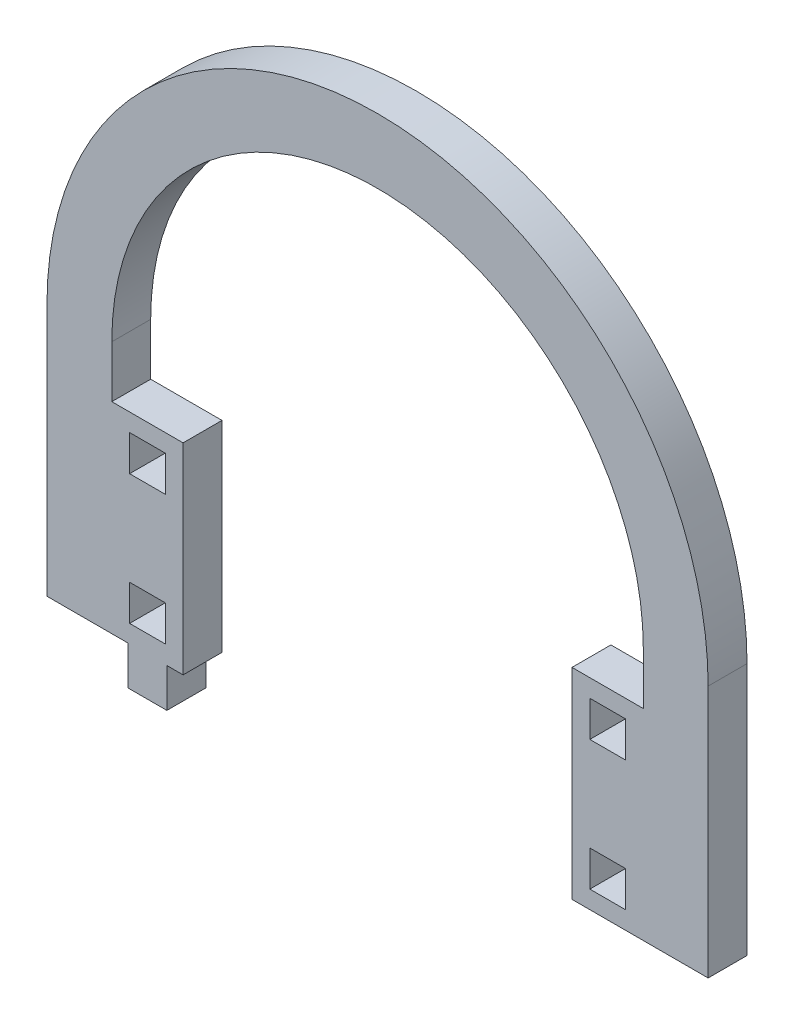
ISO-10303-21;
HEADER;
FILE_DESCRIPTION(('STEP AP214'),'2;1');
FILE_NAME('part.step','',(''),(''),'','','');
FILE_SCHEMA(('AUTOMOTIVE_DESIGN { 1 0 10303 214 1 1 1 1 }'));
ENDSEC;
DATA;
#1=APPLICATION_CONTEXT('core data for automotive mechanical design processes');
#2=APPLICATION_PROTOCOL_DEFINITION('international standard','automotive_design',2000,#1);
#3=PRODUCT_CONTEXT('',#1,'mechanical');
#4=PRODUCT('Part','Part','',(#3));
#5=PRODUCT_RELATED_PRODUCT_CATEGORY('part','',(#4));
#6=PRODUCT_DEFINITION_FORMATION('','',#4);
#7=PRODUCT_DEFINITION_CONTEXT('part definition',#1,'design');
#8=PRODUCT_DEFINITION('design','',#6,#7);
#9=PRODUCT_DEFINITION_SHAPE('','',#8);
#10=(LENGTH_UNIT() NAMED_UNIT(*) SI_UNIT(.MILLI.,.METRE.));
#11=(NAMED_UNIT(*) PLANE_ANGLE_UNIT() SI_UNIT($,.RADIAN.));
#12=(NAMED_UNIT(*) SI_UNIT($,.STERADIAN.) SOLID_ANGLE_UNIT());
#13=UNCERTAINTY_MEASURE_WITH_UNIT(LENGTH_MEASURE(1.E-05),#10,'distance_accuracy_value','');
#14=(GEOMETRIC_REPRESENTATION_CONTEXT(3) GLOBAL_UNCERTAINTY_ASSIGNED_CONTEXT((#13)) GLOBAL_UNIT_ASSIGNED_CONTEXT((#10,
#11,#12)) REPRESENTATION_CONTEXT('',''));
#15=CARTESIAN_POINT('',(0.,0.,0.));
#16=DIRECTION('',(0.,0.,1.));
#17=DIRECTION('',(1.,0.,0.));
#18=AXIS2_PLACEMENT_3D('',#15,#16,#17);
#19=CARTESIAN_POINT('',(3033.61236918884,1260.80884612332,6.));
#20=DIRECTION('',(0.,0.,1.));
#21=DIRECTION('',(1.,0.,0.));
#22=AXIS2_PLACEMENT_3D('',#19,#20,#21);
#23=PLANE('',#22);
#24=CARTESIAN_POINT('',(3033.61236918884,1260.80884612332,6.));
#25=DIRECTION('',(0.,0.,1.));
#26=DIRECTION('',(1.,0.,0.));
#27=AXIS2_PLACEMENT_3D('',#24,#25,#26);
#28=CIRCLE('',#27,51.0000000000002);
#29=CARTESIAN_POINT('',(3084.61236918884,1260.80884612332,6.));
#30=VERTEX_POINT('',#29);
#31=CARTESIAN_POINT('',(2982.61236918884,1260.80884612332,6.));
#32=VERTEX_POINT('',#31);
#33=EDGE_CURVE('E678',#30,#32,#28,.T.);
#34=ORIENTED_EDGE('',*,*,#33,.T.);
#35=DIRECTION('',(0.,-1.,0.));
#36=VECTOR('',#35,1.);
#37=CARTESIAN_POINT('',(2982.61236918884,1260.80884612332,6.));
#38=LINE('',#37,#36);
#39=CARTESIAN_POINT('',(2982.61236918884,1221.80884612332,6.));
#40=VERTEX_POINT('',#39);
#41=EDGE_CURVE('E682',#32,#40,#38,.T.);
#42=ORIENTED_EDGE('',*,*,#41,.T.);
#43=DIRECTION('',(1.,0.,0.));
#44=VECTOR('',#43,1.);
#45=CARTESIAN_POINT('',(2982.61236918884,1221.80884612332,6.));
#46=LINE('',#45,#44);
#47=CARTESIAN_POINT('',(2995.11236918884,1221.80884612332,6.));
#48=VERTEX_POINT('',#47);
#49=EDGE_CURVE('E686',#40,#48,#46,.T.);
#50=ORIENTED_EDGE('',*,*,#49,.T.);
#51=DIRECTION('',(0.,-1.,0.));
#52=VECTOR('',#51,1.);
#53=CARTESIAN_POINT('',(2995.11236918884,1221.80884612332,6.));
#54=LINE('',#53,#52);
#55=CARTESIAN_POINT('',(2995.11236918884,1215.80884612332,6.));
#56=VERTEX_POINT('',#55);
#57=EDGE_CURVE('E689',#48,#56,#54,.T.);
#58=ORIENTED_EDGE('',*,*,#57,.T.);
#59=DIRECTION('',(1.,0.,0.));
#60=VECTOR('',#59,1.);
#61=CARTESIAN_POINT('',(2995.11236918884,1215.80884612332,6.));
#62=LINE('',#61,#60);
#63=CARTESIAN_POINT('',(3001.11236918884,1215.80884612332,6.));
#64=VERTEX_POINT('',#63);
#65=EDGE_CURVE('E692',#56,#64,#62,.T.);
#66=ORIENTED_EDGE('',*,*,#65,.T.);
#67=DIRECTION('',(0.,1.,0.));
#68=VECTOR('',#67,1.);
#69=CARTESIAN_POINT('',(3001.11236918884,1215.80884612332,6.));
#70=LINE('',#69,#68);
#71=CARTESIAN_POINT('',(3001.11236918884,1221.80884612332,6.));
#72=VERTEX_POINT('',#71);
#73=EDGE_CURVE('E695',#64,#72,#70,.T.);
#74=ORIENTED_EDGE('',*,*,#73,.T.);
#75=DIRECTION('',(1.,0.,0.));
#76=VECTOR('',#75,1.);
#77=CARTESIAN_POINT('',(3001.11236918884,1221.80884612332,6.));
#78=LINE('',#77,#76);
#79=CARTESIAN_POINT('',(3003.61236918884,1221.80884612332,6.));
#80=VERTEX_POINT('',#79);
#81=EDGE_CURVE('E698',#72,#80,#78,.T.);
#82=ORIENTED_EDGE('',*,*,#81,.T.);
#83=DIRECTION('',(0.,-1.,0.));
#84=VECTOR('',#83,1.);
#85=CARTESIAN_POINT('',(3003.61236918884,1252.80884612332,6.));
#86=LINE('',#85,#84);
#87=CARTESIAN_POINT('',(3003.61236918884,1252.80884612332,6.));
#88=VERTEX_POINT('',#87);
#89=EDGE_CURVE('E701',#88,#80,#86,.T.);
#90=ORIENTED_EDGE('',*,*,#89,.F.);
#91=DIRECTION('',(-1.,0.,0.));
#92=VECTOR('',#91,1.);
#93=CARTESIAN_POINT('',(3003.61236918884,1252.80884612332,6.));
#94=LINE('',#93,#92);
#95=CARTESIAN_POINT('',(2992.61236918884,1252.80884612332,6.));
#96=VERTEX_POINT('',#95);
#97=EDGE_CURVE('E705',#88,#96,#94,.T.);
#98=ORIENTED_EDGE('',*,*,#97,.T.);
#99=DIRECTION('',(0.,-1.,0.));
#100=VECTOR('',#99,1.);
#101=CARTESIAN_POINT('',(2992.61236918884,1260.80884612332,6.));
#102=LINE('',#101,#100);
#103=CARTESIAN_POINT('',(2992.61236918884,1260.80884612332,6.));
#104=VERTEX_POINT('',#103);
#105=EDGE_CURVE('E708',#104,#96,#102,.T.);
#106=ORIENTED_EDGE('',*,*,#105,.F.);
#107=CARTESIAN_POINT('',(3033.61236918884,1260.80884612332,6.));
#108=DIRECTION('',(0.,0.,1.));
#109=DIRECTION('',(1.,0.,0.));
#110=AXIS2_PLACEMENT_3D('',#107,#108,#109);
#111=CIRCLE('',#110,40.9999999999999);
#112=CARTESIAN_POINT('',(3074.61236918884,1260.80884612332,6.));
#113=VERTEX_POINT('',#112);
#114=EDGE_CURVE('E712',#113,#104,#111,.T.);
#115=ORIENTED_EDGE('',*,*,#114,.F.);
#116=DIRECTION('',(0.,-1.,0.));
#117=VECTOR('',#116,1.);
#118=CARTESIAN_POINT('',(3074.61236918884,1260.80884612332,6.));
#119=LINE('',#118,#117);
#120=CARTESIAN_POINT('',(3074.61236918884,1252.80884612332,6.));
#121=VERTEX_POINT('',#120);
#122=EDGE_CURVE('E716',#113,#121,#119,.T.);
#123=ORIENTED_EDGE('',*,*,#122,.T.);
#124=DIRECTION('',(-1.,0.,0.));
#125=VECTOR('',#124,1.);
#126=CARTESIAN_POINT('',(3074.61236918884,1252.80884612332,6.));
#127=LINE('',#126,#125);
#128=CARTESIAN_POINT('',(3063.61236918884,1252.80884612332,6.));
#129=VERTEX_POINT('',#128);
#130=EDGE_CURVE('E719',#121,#129,#127,.T.);
#131=ORIENTED_EDGE('',*,*,#130,.T.);
#132=DIRECTION('',(0.,-1.,0.));
#133=VECTOR('',#132,1.);
#134=CARTESIAN_POINT('',(3063.61236918884,1252.80884612332,6.));
#135=LINE('',#134,#133);
#136=CARTESIAN_POINT('',(3063.61236918884,1221.80884612332,6.));
#137=VERTEX_POINT('',#136);
#138=EDGE_CURVE('E722',#129,#137,#135,.T.);
#139=ORIENTED_EDGE('',*,*,#138,.T.);
#140=DIRECTION('',(1.,0.,0.));
#141=VECTOR('',#140,1.);
#142=CARTESIAN_POINT('',(3063.61236918884,1221.80884612332,6.));
#143=LINE('',#142,#141);
#144=CARTESIAN_POINT('',(3084.61236918884,1221.80884612332,6.));
#145=VERTEX_POINT('',#144);
#146=EDGE_CURVE('E725',#137,#145,#143,.T.);
#147=ORIENTED_EDGE('',*,*,#146,.T.);
#148=DIRECTION('',(0.,-1.,0.));
#149=VECTOR('',#148,1.);
#150=CARTESIAN_POINT('',(3084.61236918884,1260.80884612332,6.));
#151=LINE('',#150,#149);
#152=EDGE_CURVE('E728',#30,#145,#151,.T.);
#153=ORIENTED_EDGE('',*,*,#152,.F.);
#154=EDGE_LOOP('',(#34,#42,#50,#58,#66,#74,#82,#90,#98,#106,#115,#123,#131,#139,#147,#153));
#155=FACE_BOUND('',#154,.T.);
#156=DIRECTION('',(0.,1.,0.));
#157=VECTOR('',#156,1.);
#158=CARTESIAN_POINT('',(3000.86236918884,0.,6.));
#159=LINE('',#158,#157);
#160=CARTESIAN_POINT('',(3000.86236918884,1224.55884612332,6.));
#161=VERTEX_POINT('',#160);
#162=CARTESIAN_POINT('',(3000.86236918884,1230.05884612332,6.));
#163=VERTEX_POINT('',#162);
#164=EDGE_CURVE('E638',#161,#163,#159,.T.);
#165=ORIENTED_EDGE('',*,*,#164,.F.);
#166=DIRECTION('',(1.,0.,0.));
#167=VECTOR('',#166,1.);
#168=CARTESIAN_POINT('',(0.,1224.55884612332,6.));
#169=LINE('',#168,#167);
#170=CARTESIAN_POINT('',(2995.36236918884,1224.55884612332,6.));
#171=VERTEX_POINT('',#170);
#172=EDGE_CURVE('E635',#171,#161,#169,.T.);
#173=ORIENTED_EDGE('',*,*,#172,.F.);
#174=DIRECTION('',(0.,-1.,0.));
#175=VECTOR('',#174,1.);
#176=CARTESIAN_POINT('',(2995.36236918884,0.,6.));
#177=LINE('',#176,#175);
#178=CARTESIAN_POINT('',(2995.36236918884,1230.05884612332,6.));
#179=VERTEX_POINT('',#178);
#180=EDGE_CURVE('E646',#179,#171,#177,.T.);
#181=ORIENTED_EDGE('',*,*,#180,.F.);
#182=DIRECTION('',(-1.,0.,0.));
#183=VECTOR('',#182,1.);
#184=CARTESIAN_POINT('',(0.,1230.05884612332,6.));
#185=LINE('',#184,#183);
#186=EDGE_CURVE('E642',#163,#179,#185,.T.);
#187=ORIENTED_EDGE('',*,*,#186,.F.);
#188=EDGE_LOOP('',(#165,#173,#181,#187));
#189=FACE_BOUND('',#188,.T.);
#190=DIRECTION('',(0.,1.,0.));
#191=VECTOR('',#190,1.);
#192=CARTESIAN_POINT('',(3071.86236918884,0.,6.));
#193=LINE('',#192,#191);
#194=CARTESIAN_POINT('',(3071.86236918884,1244.55884612332,6.));
#195=VERTEX_POINT('',#194);
#196=CARTESIAN_POINT('',(3071.86236918884,1250.05884612332,6.));
#197=VERTEX_POINT('',#196);
#198=EDGE_CURVE('E595',#195,#197,#193,.T.);
#199=ORIENTED_EDGE('',*,*,#198,.F.);
#200=DIRECTION('',(1.,0.,0.));
#201=VECTOR('',#200,1.);
#202=CARTESIAN_POINT('',(0.,1244.55884612332,6.));
#203=LINE('',#202,#201);
#204=CARTESIAN_POINT('',(3066.36236918884,1244.55884612332,6.));
#205=VERTEX_POINT('',#204);
#206=EDGE_CURVE('E592',#205,#195,#203,.T.);
#207=ORIENTED_EDGE('',*,*,#206,.F.);
#208=DIRECTION('',(0.,-1.,0.));
#209=VECTOR('',#208,1.);
#210=CARTESIAN_POINT('',(3066.36236918884,0.,6.));
#211=LINE('',#210,#209);
#212=CARTESIAN_POINT('',(3066.36236918884,1250.05884612332,6.));
#213=VERTEX_POINT('',#212);
#214=EDGE_CURVE('E603',#213,#205,#211,.T.);
#215=ORIENTED_EDGE('',*,*,#214,.F.);
#216=DIRECTION('',(-1.,0.,0.));
#217=VECTOR('',#216,1.);
#218=CARTESIAN_POINT('',(0.,1250.05884612332,6.));
#219=LINE('',#218,#217);
#220=EDGE_CURVE('E599',#197,#213,#219,.T.);
#221=ORIENTED_EDGE('',*,*,#220,.F.);
#222=EDGE_LOOP('',(#199,#207,#215,#221));
#223=FACE_BOUND('',#222,.T.);
#224=DIRECTION('',(0.,1.,0.));
#225=VECTOR('',#224,1.);
#226=CARTESIAN_POINT('',(3071.86236918884,0.,6.));
#227=LINE('',#226,#225);
#228=CARTESIAN_POINT('',(3071.86236918884,1224.55884612332,6.));
#229=VERTEX_POINT('',#228);
#230=CARTESIAN_POINT('',(3071.86236918884,1230.05884612332,6.));
#231=VERTEX_POINT('',#230);
#232=EDGE_CURVE('E552',#229,#231,#227,.T.);
#233=ORIENTED_EDGE('',*,*,#232,.F.);
#234=DIRECTION('',(1.,0.,0.));
#235=VECTOR('',#234,1.);
#236=CARTESIAN_POINT('',(0.,1224.55884612332,6.));
#237=LINE('',#236,#235);
#238=CARTESIAN_POINT('',(3066.36236918884,1224.55884612332,6.));
#239=VERTEX_POINT('',#238);
#240=EDGE_CURVE('E549',#239,#229,#237,.T.);
#241=ORIENTED_EDGE('',*,*,#240,.F.);
#242=DIRECTION('',(0.,-1.,0.));
#243=VECTOR('',#242,1.);
#244=CARTESIAN_POINT('',(3066.36236918884,0.,6.));
#245=LINE('',#244,#243);
#246=CARTESIAN_POINT('',(3066.36236918884,1230.05884612332,6.));
#247=VERTEX_POINT('',#246);
#248=EDGE_CURVE('E560',#247,#239,#245,.T.);
#249=ORIENTED_EDGE('',*,*,#248,.F.);
#250=DIRECTION('',(-1.,0.,0.));
#251=VECTOR('',#250,1.);
#252=CARTESIAN_POINT('',(0.,1230.05884612332,6.));
#253=LINE('',#252,#251);
#254=EDGE_CURVE('E556',#231,#247,#253,.T.);
#255=ORIENTED_EDGE('',*,*,#254,.F.);
#256=EDGE_LOOP('',(#233,#241,#249,#255));
#257=FACE_BOUND('',#256,.T.);
#258=DIRECTION('',(1.,0.,0.));
#259=VECTOR('',#258,1.);
#260=CARTESIAN_POINT('',(2995.36236918884,1244.55884612332,6.));
#261=LINE('',#260,#259);
#262=CARTESIAN_POINT('',(2995.36236918884,1244.55884612332,6.));
#263=VERTEX_POINT('',#262);
#264=CARTESIAN_POINT('',(3000.86236918884,1244.55884612332,6.));
#265=VERTEX_POINT('',#264);
#266=EDGE_CURVE('E510',#263,#265,#261,.T.);
#267=ORIENTED_EDGE('',*,*,#266,.F.);
#268=DIRECTION('',(0.,-1.,0.));
#269=VECTOR('',#268,1.);
#270=CARTESIAN_POINT('',(2995.36236918884,1250.05884612332,6.));
#271=LINE('',#270,#269);
#272=CARTESIAN_POINT('',(2995.36236918884,1250.05884612332,6.));
#273=VERTEX_POINT('',#272);
#274=EDGE_CURVE('E501',#273,#263,#271,.T.);
#275=ORIENTED_EDGE('',*,*,#274,.F.);
#276=DIRECTION('',(-1.,0.,0.));
#277=VECTOR('',#276,1.);
#278=CARTESIAN_POINT('',(3000.86236918884,1250.05884612332,6.));
#279=LINE('',#278,#277);
#280=CARTESIAN_POINT('',(3000.86236918884,1250.05884612332,6.));
#281=VERTEX_POINT('',#280);
#282=EDGE_CURVE('E527',#281,#273,#279,.T.);
#283=ORIENTED_EDGE('',*,*,#282,.F.);
#284=DIRECTION('',(0.,1.,0.));
#285=VECTOR('',#284,1.);
#286=CARTESIAN_POINT('',(3000.86236918884,1244.55884612332,6.));
#287=LINE('',#286,#285);
#288=EDGE_CURVE('E523',#265,#281,#287,.T.);
#289=ORIENTED_EDGE('',*,*,#288,.F.);
#290=EDGE_LOOP('',(#267,#275,#283,#289));
#291=FACE_BOUND('',#290,.T.);
#292=ADVANCED_FACE('F291',(#155,#189,#223,#257,#291),#23,.T.);
#293=CARTESIAN_POINT('',(3033.61236918884,1260.80884612332,0.));
#294=DIRECTION('',(0.,0.,1.));
#295=DIRECTION('',(1.,0.,0.));
#296=AXIS2_PLACEMENT_3D('',#293,#294,#295);
#297=PLANE('',#296);
#298=DIRECTION('',(1.,0.,0.));
#299=VECTOR('',#298,1.);
#300=CARTESIAN_POINT('',(0.,1224.55884612332,0.));
#301=LINE('',#300,#299);
#302=CARTESIAN_POINT('',(3066.36236918884,1224.55884612332,0.));
#303=VERTEX_POINT('',#302);
#304=CARTESIAN_POINT('',(3071.86236918884,1224.55884612332,0.));
#305=VERTEX_POINT('',#304);
#306=EDGE_CURVE('E519',#303,#305,#301,.T.);
#307=ORIENTED_EDGE('',*,*,#306,.T.);
#308=DIRECTION('',(0.,1.,0.));
#309=VECTOR('',#308,1.);
#310=CARTESIAN_POINT('',(3071.86236918884,0.,0.));
#311=LINE('',#310,#309);
#312=CARTESIAN_POINT('',(3071.86236918884,1230.05884612332,0.));
#313=VERTEX_POINT('',#312);
#314=EDGE_CURVE('E567',#305,#313,#311,.T.);
#315=ORIENTED_EDGE('',*,*,#314,.T.);
#316=DIRECTION('',(-1.,0.,0.));
#317=VECTOR('',#316,1.);
#318=CARTESIAN_POINT('',(0.,1230.05884612332,0.));
#319=LINE('',#318,#317);
#320=CARTESIAN_POINT('',(3066.36236918884,1230.05884612332,0.));
#321=VERTEX_POINT('',#320);
#322=EDGE_CURVE('E571',#313,#321,#319,.T.);
#323=ORIENTED_EDGE('',*,*,#322,.T.);
#324=DIRECTION('',(0.,-1.,0.));
#325=VECTOR('',#324,1.);
#326=CARTESIAN_POINT('',(3066.36236918884,0.,0.));
#327=LINE('',#326,#325);
#328=EDGE_CURVE('E553',#321,#303,#327,.T.);
#329=ORIENTED_EDGE('',*,*,#328,.T.);
#330=EDGE_LOOP('',(#307,#315,#323,#329));
#331=FACE_BOUND('',#330,.T.);
#332=DIRECTION('',(1.,0.,0.));
#333=VECTOR('',#332,1.);
#334=CARTESIAN_POINT('',(0.,1224.55884612332,0.));
#335=LINE('',#334,#333);
#336=CARTESIAN_POINT('',(2995.36236918884,1224.55884612332,0.));
#337=VERTEX_POINT('',#336);
#338=CARTESIAN_POINT('',(3000.86236918884,1224.55884612332,0.));
#339=VERTEX_POINT('',#338);
#340=EDGE_CURVE('E634',#337,#339,#335,.T.);
#341=ORIENTED_EDGE('',*,*,#340,.T.);
#342=DIRECTION('',(0.,1.,0.));
#343=VECTOR('',#342,1.);
#344=CARTESIAN_POINT('',(3000.86236918884,0.,0.));
#345=LINE('',#344,#343);
#346=CARTESIAN_POINT('',(3000.86236918884,1230.05884612332,0.));
#347=VERTEX_POINT('',#346);
#348=EDGE_CURVE('E653',#339,#347,#345,.T.);
#349=ORIENTED_EDGE('',*,*,#348,.T.);
#350=DIRECTION('',(-1.,0.,0.));
#351=VECTOR('',#350,1.);
#352=CARTESIAN_POINT('',(0.,1230.05884612332,0.));
#353=LINE('',#352,#351);
#354=CARTESIAN_POINT('',(2995.36236918884,1230.05884612332,0.));
#355=VERTEX_POINT('',#354);
#356=EDGE_CURVE('E657',#347,#355,#353,.T.);
#357=ORIENTED_EDGE('',*,*,#356,.T.);
#358=DIRECTION('',(0.,-1.,0.));
#359=VECTOR('',#358,1.);
#360=CARTESIAN_POINT('',(2995.36236918884,0.,0.));
#361=LINE('',#360,#359);
#362=EDGE_CURVE('E639',#355,#337,#361,.T.);
#363=ORIENTED_EDGE('',*,*,#362,.T.);
#364=EDGE_LOOP('',(#341,#349,#357,#363));
#365=FACE_BOUND('',#364,.T.);
#366=CARTESIAN_POINT('',(3033.61236918884,1260.80884612332,0.));
#367=DIRECTION('',(0.,0.,1.));
#368=DIRECTION('',(1.,0.,0.));
#369=AXIS2_PLACEMENT_3D('',#366,#367,#368);
#370=CIRCLE('',#369,51.0000000000002);
#371=CARTESIAN_POINT('',(3084.61236918884,1260.80884612332,0.));
#372=VERTEX_POINT('',#371);
#373=CARTESIAN_POINT('',(2982.61236918884,1260.80884612332,0.));
#374=VERTEX_POINT('',#373);
#375=EDGE_CURVE('E677',#372,#374,#370,.T.);
#376=ORIENTED_EDGE('',*,*,#375,.F.);
#377=DIRECTION('',(0.,-1.,0.));
#378=VECTOR('',#377,1.);
#379=CARTESIAN_POINT('',(3084.61236918884,1260.80884612332,0.));
#380=LINE('',#379,#378);
#381=CARTESIAN_POINT('',(3084.61236918884,1221.80884612332,0.));
#382=VERTEX_POINT('',#381);
#383=EDGE_CURVE('E683',#372,#382,#380,.T.);
#384=ORIENTED_EDGE('',*,*,#383,.T.);
#385=DIRECTION('',(1.,0.,0.));
#386=VECTOR('',#385,1.);
#387=CARTESIAN_POINT('',(3074.61236918884,1221.80884612332,0.));
#388=LINE('',#387,#386);
#389=CARTESIAN_POINT('',(3063.61236918884,1221.80884612332,0.));
#390=VERTEX_POINT('',#389);
#391=EDGE_CURVE('E781',#390,#382,#388,.T.);
#392=ORIENTED_EDGE('',*,*,#391,.F.);
#393=DIRECTION('',(0.,-1.,0.));
#394=VECTOR('',#393,1.);
#395=CARTESIAN_POINT('',(3063.61236918884,1252.80884612332,0.));
#396=LINE('',#395,#394);
#397=CARTESIAN_POINT('',(3063.61236918884,1252.80884612332,0.));
#398=VERTEX_POINT('',#397);
#399=EDGE_CURVE('E777',#398,#390,#396,.T.);
#400=ORIENTED_EDGE('',*,*,#399,.F.);
#401=DIRECTION('',(-1.,0.,0.));
#402=VECTOR('',#401,1.);
#403=CARTESIAN_POINT('',(3074.61236918884,1252.80884612332,0.));
#404=LINE('',#403,#402);
#405=CARTESIAN_POINT('',(3074.61236918884,1252.80884612332,0.));
#406=VERTEX_POINT('',#405);
#407=EDGE_CURVE('E774',#406,#398,#404,.T.);
#408=ORIENTED_EDGE('',*,*,#407,.F.);
#409=DIRECTION('',(0.,-1.,0.));
#410=VECTOR('',#409,1.);
#411=CARTESIAN_POINT('',(3074.61236918884,1260.80884612332,0.));
#412=LINE('',#411,#410);
#413=CARTESIAN_POINT('',(3074.61236918884,1260.80884612332,0.));
#414=VERTEX_POINT('',#413);
#415=EDGE_CURVE('E771',#414,#406,#412,.T.);
#416=ORIENTED_EDGE('',*,*,#415,.F.);
#417=CARTESIAN_POINT('',(3033.61236918884,1260.80884612332,0.));
#418=DIRECTION('',(0.,0.,1.));
#419=DIRECTION('',(1.,0.,0.));
#420=AXIS2_PLACEMENT_3D('',#417,#418,#419);
#421=CIRCLE('',#420,40.9999999999999);
#422=CARTESIAN_POINT('',(2992.61236918884,1260.80884612332,0.));
#423=VERTEX_POINT('',#422);
#424=EDGE_CURVE('E767',#414,#423,#421,.T.);
#425=ORIENTED_EDGE('',*,*,#424,.T.);
#426=DIRECTION('',(0.,-1.,0.));
#427=VECTOR('',#426,1.);
#428=CARTESIAN_POINT('',(2992.61236918884,1260.80884612332,0.));
#429=LINE('',#428,#427);
#430=CARTESIAN_POINT('',(2992.61236918884,1252.80884612332,0.));
#431=VERTEX_POINT('',#430);
#432=EDGE_CURVE('E763',#423,#431,#429,.T.);
#433=ORIENTED_EDGE('',*,*,#432,.T.);
#434=DIRECTION('',(-1.,0.,0.));
#435=VECTOR('',#434,1.);
#436=CARTESIAN_POINT('',(3003.61236918884,1252.80884612332,0.));
#437=LINE('',#436,#435);
#438=CARTESIAN_POINT('',(3003.61236918884,1252.80884612332,0.));
#439=VERTEX_POINT('',#438);
#440=EDGE_CURVE('E759',#439,#431,#437,.T.);
#441=ORIENTED_EDGE('',*,*,#440,.F.);
#442=DIRECTION('',(0.,-1.,0.));
#443=VECTOR('',#442,1.);
#444=CARTESIAN_POINT('',(3003.61236918884,1252.80884612332,0.));
#445=LINE('',#444,#443);
#446=CARTESIAN_POINT('',(3003.61236918884,1221.80884612332,0.));
#447=VERTEX_POINT('',#446);
#448=EDGE_CURVE('E755',#439,#447,#445,.T.);
#449=ORIENTED_EDGE('',*,*,#448,.T.);
#450=DIRECTION('',(1.,0.,0.));
#451=VECTOR('',#450,1.);
#452=CARTESIAN_POINT('',(3001.11236918884,1221.80884612332,0.));
#453=LINE('',#452,#451);
#454=CARTESIAN_POINT('',(3001.11236918884,1221.80884612332,0.));
#455=VERTEX_POINT('',#454);
#456=EDGE_CURVE('E751',#455,#447,#453,.T.);
#457=ORIENTED_EDGE('',*,*,#456,.F.);
#458=DIRECTION('',(0.,1.,0.));
#459=VECTOR('',#458,1.);
#460=CARTESIAN_POINT('',(3001.11236918884,1215.80884612332,0.));
#461=LINE('',#460,#459);
#462=CARTESIAN_POINT('',(3001.11236918884,1215.80884612332,0.));
#463=VERTEX_POINT('',#462);
#464=EDGE_CURVE('E748',#463,#455,#461,.T.);
#465=ORIENTED_EDGE('',*,*,#464,.F.);
#466=DIRECTION('',(1.,0.,0.));
#467=VECTOR('',#466,1.);
#468=CARTESIAN_POINT('',(2995.11236918884,1215.80884612332,0.));
#469=LINE('',#468,#467);
#470=CARTESIAN_POINT('',(2995.11236918884,1215.80884612332,0.));
#471=VERTEX_POINT('',#470);
#472=EDGE_CURVE('E745',#471,#463,#469,.T.);
#473=ORIENTED_EDGE('',*,*,#472,.F.);
#474=DIRECTION('',(0.,-1.,0.));
#475=VECTOR('',#474,1.);
#476=CARTESIAN_POINT('',(2995.11236918884,1221.80884612332,0.));
#477=LINE('',#476,#475);
#478=CARTESIAN_POINT('',(2995.11236918884,1221.80884612332,0.));
#479=VERTEX_POINT('',#478);
#480=EDGE_CURVE('E742',#479,#471,#477,.T.);
#481=ORIENTED_EDGE('',*,*,#480,.F.);
#482=DIRECTION('',(1.,0.,0.));
#483=VECTOR('',#482,1.);
#484=CARTESIAN_POINT('',(2982.61236918884,1221.80884612332,0.));
#485=LINE('',#484,#483);
#486=CARTESIAN_POINT('',(2982.61236918884,1221.80884612332,0.));
#487=VERTEX_POINT('',#486);
#488=EDGE_CURVE('E739',#487,#479,#485,.T.);
#489=ORIENTED_EDGE('',*,*,#488,.F.);
#490=DIRECTION('',(0.,-1.,0.));
#491=VECTOR('',#490,1.);
#492=CARTESIAN_POINT('',(2982.61236918884,1260.80884612332,0.));
#493=LINE('',#492,#491);
#494=EDGE_CURVE('E736',#374,#487,#493,.T.);
#495=ORIENTED_EDGE('',*,*,#494,.F.);
#496=EDGE_LOOP('',(#376,#384,#392,#400,#408,#416,#425,#433,#441,#449,#457,#465,#473,#481,#489,#495));
#497=FACE_BOUND('',#496,.T.);
#498=DIRECTION('',(1.,0.,0.));
#499=VECTOR('',#498,1.);
#500=CARTESIAN_POINT('',(0.,1244.55884612332,0.));
#501=LINE('',#500,#499);
#502=CARTESIAN_POINT('',(3066.36236918884,1244.55884612332,0.));
#503=VERTEX_POINT('',#502);
#504=CARTESIAN_POINT('',(3071.86236918884,1244.55884612332,0.));
#505=VERTEX_POINT('',#504);
#506=EDGE_CURVE('E591',#503,#505,#501,.T.);
#507=ORIENTED_EDGE('',*,*,#506,.T.);
#508=DIRECTION('',(0.,1.,0.));
#509=VECTOR('',#508,1.);
#510=CARTESIAN_POINT('',(3071.86236918884,0.,0.));
#511=LINE('',#510,#509);
#512=CARTESIAN_POINT('',(3071.86236918884,1250.05884612332,0.));
#513=VERTEX_POINT('',#512);
#514=EDGE_CURVE('E610',#505,#513,#511,.T.);
#515=ORIENTED_EDGE('',*,*,#514,.T.);
#516=DIRECTION('',(-1.,0.,0.));
#517=VECTOR('',#516,1.);
#518=CARTESIAN_POINT('',(0.,1250.05884612332,0.));
#519=LINE('',#518,#517);
#520=CARTESIAN_POINT('',(3066.36236918884,1250.05884612332,0.));
#521=VERTEX_POINT('',#520);
#522=EDGE_CURVE('E614',#513,#521,#519,.T.);
#523=ORIENTED_EDGE('',*,*,#522,.T.);
#524=DIRECTION('',(0.,-1.,0.));
#525=VECTOR('',#524,1.);
#526=CARTESIAN_POINT('',(3066.36236918884,0.,0.));
#527=LINE('',#526,#525);
#528=EDGE_CURVE('E596',#521,#503,#527,.T.);
#529=ORIENTED_EDGE('',*,*,#528,.T.);
#530=EDGE_LOOP('',(#507,#515,#523,#529));
#531=FACE_BOUND('',#530,.T.);
#532=DIRECTION('',(0.,-1.,0.));
#533=VECTOR('',#532,1.);
#534=CARTESIAN_POINT('',(2995.36236918884,1250.05884612332,0.));
#535=LINE('',#534,#533);
#536=CARTESIAN_POINT('',(2995.36236918884,1250.05884612332,0.));
#537=VERTEX_POINT('',#536);
#538=CARTESIAN_POINT('',(2995.36236918884,1244.55884612332,0.));
#539=VERTEX_POINT('',#538);
#540=EDGE_CURVE('E315',#537,#539,#535,.T.);
#541=ORIENTED_EDGE('',*,*,#540,.T.);
#542=DIRECTION('',(1.,0.,0.));
#543=VECTOR('',#542,1.);
#544=CARTESIAN_POINT('',(2995.36236918884,1244.55884612332,0.));
#545=LINE('',#544,#543);
#546=CARTESIAN_POINT('',(3000.86236918884,1244.55884612332,0.));
#547=VERTEX_POINT('',#546);
#548=EDGE_CURVE('E517',#539,#547,#545,.T.);
#549=ORIENTED_EDGE('',*,*,#548,.T.);
#550=DIRECTION('',(0.,1.,0.));
#551=VECTOR('',#550,1.);
#552=CARTESIAN_POINT('',(3000.86236918884,1244.55884612332,0.));
#553=LINE('',#552,#551);
#554=CARTESIAN_POINT('',(3000.86236918884,1250.05884612332,0.));
#555=VERTEX_POINT('',#554);
#556=EDGE_CURVE('E536',#547,#555,#553,.T.);
#557=ORIENTED_EDGE('',*,*,#556,.T.);
#558=DIRECTION('',(-1.,0.,0.));
#559=VECTOR('',#558,1.);
#560=CARTESIAN_POINT('',(3000.86236918884,1250.05884612332,0.));
#561=LINE('',#560,#559);
#562=EDGE_CURVE('E511',#555,#537,#561,.T.);
#563=ORIENTED_EDGE('',*,*,#562,.T.);
#564=EDGE_LOOP('',(#541,#549,#557,#563));
#565=FACE_BOUND('',#564,.T.);
#566=ADVANCED_FACE('F847',(#331,#365,#497,#531,#565),#297,.F.);
#567=CARTESIAN_POINT('',(3033.61236918884,1260.80884612332,6.));
#568=DIRECTION('',(0.,0.,-1.));
#569=DIRECTION('',(-1.,0.,0.));
#570=AXIS2_PLACEMENT_3D('',#567,#568,#569);
#571=CYLINDRICAL_SURFACE('',#570,51.0000000000002);
#572=ORIENTED_EDGE('',*,*,#375,.T.);
#573=DIRECTION('',(0.,0.,-1.));
#574=VECTOR('',#573,1.);
#575=CARTESIAN_POINT('',(2982.61236918884,1260.80884612332,6.));
#576=LINE('',#575,#574);
#577=EDGE_CURVE('E12',#32,#374,#576,.T.);
#578=ORIENTED_EDGE('',*,*,#577,.F.);
#579=ORIENTED_EDGE('',*,*,#33,.F.);
#580=DIRECTION('',(0.,0.,-1.));
#581=VECTOR('',#580,1.);
#582=CARTESIAN_POINT('',(3084.61236918884,1260.80884612332,6.));
#583=LINE('',#582,#581);
#584=EDGE_CURVE('E732',#30,#372,#583,.T.);
#585=ORIENTED_EDGE('',*,*,#584,.T.);
#586=EDGE_LOOP('',(#572,#578,#579,#585));
#587=FACE_BOUND('',#586,.T.);
#588=ADVANCED_FACE('F293',(#587),#571,.T.);
#589=CARTESIAN_POINT('',(2982.61236918884,1260.80884612332,6.));
#590=DIRECTION('',(1.,0.,0.));
#591=DIRECTION('',(0.,0.,-1.));
#592=AXIS2_PLACEMENT_3D('',#589,#590,#591);
#593=PLANE('',#592);
#594=ORIENTED_EDGE('',*,*,#494,.T.);
#595=DIRECTION('',(0.,0.,-1.));
#596=VECTOR('',#595,1.);
#597=CARTESIAN_POINT('',(2982.61236918884,1221.80884612332,6.));
#598=LINE('',#597,#596);
#599=EDGE_CURVE('E300',#40,#487,#598,.T.);
#600=ORIENTED_EDGE('',*,*,#599,.F.);
#601=ORIENTED_EDGE('',*,*,#41,.F.);
#602=ORIENTED_EDGE('',*,*,#577,.T.);
#603=EDGE_LOOP('',(#594,#600,#601,#602));
#604=FACE_BOUND('',#603,.T.);
#605=ADVANCED_FACE('F866',(#604),#593,.F.);
#606=CARTESIAN_POINT('',(2982.61236918884,1221.80884612332,6.));
#607=DIRECTION('',(0.,1.,0.));
#608=DIRECTION('',(0.,0.,1.));
#609=AXIS2_PLACEMENT_3D('',#606,#607,#608);
#610=PLANE('',#609);
#611=ORIENTED_EDGE('',*,*,#488,.T.);
#612=DIRECTION('',(0.,0.,-1.));
#613=VECTOR('',#612,1.);
#614=CARTESIAN_POINT('',(2995.11236918884,1221.80884612332,6.));
#615=LINE('',#614,#613);
#616=EDGE_CURVE('E832',#48,#479,#615,.T.);
#617=ORIENTED_EDGE('',*,*,#616,.F.);
#618=ORIENTED_EDGE('',*,*,#49,.F.);
#619=ORIENTED_EDGE('',*,*,#599,.T.);
#620=EDGE_LOOP('',(#611,#617,#618,#619));
#621=FACE_BOUND('',#620,.T.);
#622=ADVANCED_FACE('F841',(#621),#610,.F.);
#623=CARTESIAN_POINT('',(2995.11236918884,1221.80884612332,6.));
#624=DIRECTION('',(1.,0.,0.));
#625=DIRECTION('',(0.,0.,-1.));
#626=AXIS2_PLACEMENT_3D('',#623,#624,#625);
#627=PLANE('',#626);
#628=ORIENTED_EDGE('',*,*,#480,.T.);
#629=DIRECTION('',(0.,0.,-1.));
#630=VECTOR('',#629,1.);
#631=CARTESIAN_POINT('',(2995.11236918884,1215.80884612332,6.));
#632=LINE('',#631,#630);
#633=EDGE_CURVE('E828',#56,#471,#632,.T.);
#634=ORIENTED_EDGE('',*,*,#633,.F.);
#635=ORIENTED_EDGE('',*,*,#57,.F.);
#636=ORIENTED_EDGE('',*,*,#616,.T.);
#637=EDGE_LOOP('',(#628,#634,#635,#636));
#638=FACE_BOUND('',#637,.T.);
#639=ADVANCED_FACE('F853',(#638),#627,.F.);
#640=CARTESIAN_POINT('',(2995.11236918884,1215.80884612332,6.));
#641=DIRECTION('',(0.,1.,0.));
#642=DIRECTION('',(0.,0.,1.));
#643=AXIS2_PLACEMENT_3D('',#640,#641,#642);
#644=PLANE('',#643);
#645=ORIENTED_EDGE('',*,*,#472,.T.);
#646=DIRECTION('',(0.,0.,-1.));
#647=VECTOR('',#646,1.);
#648=CARTESIAN_POINT('',(3001.11236918884,1215.80884612332,6.));
#649=LINE('',#648,#647);
#650=EDGE_CURVE('E824',#64,#463,#649,.T.);
#651=ORIENTED_EDGE('',*,*,#650,.F.);
#652=ORIENTED_EDGE('',*,*,#65,.F.);
#653=ORIENTED_EDGE('',*,*,#633,.T.);
#654=EDGE_LOOP('',(#645,#651,#652,#653));
#655=FACE_BOUND('',#654,.T.);
#656=ADVANCED_FACE('F857',(#655),#644,.F.);
#657=CARTESIAN_POINT('',(3001.11236918884,1215.80884612332,6.));
#658=DIRECTION('',(-1.,0.,0.));
#659=DIRECTION('',(0.,0.,1.));
#660=AXIS2_PLACEMENT_3D('',#657,#658,#659);
#661=PLANE('',#660);
#662=ORIENTED_EDGE('',*,*,#464,.T.);
#663=DIRECTION('',(0.,0.,-1.));
#664=VECTOR('',#663,1.);
#665=CARTESIAN_POINT('',(3001.11236918884,1221.80884612332,6.));
#666=LINE('',#665,#664);
#667=EDGE_CURVE('E820',#72,#455,#666,.T.);
#668=ORIENTED_EDGE('',*,*,#667,.F.);
#669=ORIENTED_EDGE('',*,*,#73,.F.);
#670=ORIENTED_EDGE('',*,*,#650,.T.);
#671=EDGE_LOOP('',(#662,#668,#669,#670));
#672=FACE_BOUND('',#671,.T.);
#673=ADVANCED_FACE('F911',(#672),#661,.F.);
#674=CARTESIAN_POINT('',(3001.11236918884,1221.80884612332,6.));
#675=DIRECTION('',(0.,1.,0.));
#676=DIRECTION('',(0.,0.,1.));
#677=AXIS2_PLACEMENT_3D('',#674,#675,#676);
#678=PLANE('',#677);
#679=ORIENTED_EDGE('',*,*,#456,.T.);
#680=DIRECTION('',(0.,0.,-1.));
#681=VECTOR('',#680,1.);
#682=CARTESIAN_POINT('',(3003.61236918884,1221.80884612332,6.));
#683=LINE('',#682,#681);
#684=EDGE_CURVE('E817',#80,#447,#683,.T.);
#685=ORIENTED_EDGE('',*,*,#684,.F.);
#686=ORIENTED_EDGE('',*,*,#81,.F.);
#687=ORIENTED_EDGE('',*,*,#667,.T.);
#688=EDGE_LOOP('',(#679,#685,#686,#687));
#689=FACE_BOUND('',#688,.T.);
#690=ADVANCED_FACE('F909',(#689),#678,.F.);
#691=CARTESIAN_POINT('',(3003.61236918884,1252.80884612332,6.));
#692=DIRECTION('',(1.,0.,0.));
#693=DIRECTION('',(0.,0.,-1.));
#694=AXIS2_PLACEMENT_3D('',#691,#692,#693);
#695=PLANE('',#694);
#696=ORIENTED_EDGE('',*,*,#448,.F.);
#697=DIRECTION('',(0.,0.,-1.));
#698=VECTOR('',#697,1.);
#699=CARTESIAN_POINT('',(3003.61236918884,1252.80884612332,6.));
#700=LINE('',#699,#698);
#701=EDGE_CURVE('E814',#88,#439,#700,.T.);
#702=ORIENTED_EDGE('',*,*,#701,.F.);
#703=ORIENTED_EDGE('',*,*,#89,.T.);
#704=ORIENTED_EDGE('',*,*,#684,.T.);
#705=EDGE_LOOP('',(#696,#702,#703,#704));
#706=FACE_BOUND('',#705,.T.);
#707=ADVANCED_FACE('F903',(#706),#695,.T.);
#708=CARTESIAN_POINT('',(3003.61236918884,1252.80884612332,6.));
#709=DIRECTION('',(0.,-1.,0.));
#710=DIRECTION('',(0.,0.,-1.));
#711=AXIS2_PLACEMENT_3D('',#708,#709,#710);
#712=PLANE('',#711);
#713=ORIENTED_EDGE('',*,*,#440,.T.);
#714=DIRECTION('',(0.,0.,-1.));
#715=VECTOR('',#714,1.);
#716=CARTESIAN_POINT('',(2992.61236918884,1252.80884612332,6.));
#717=LINE('',#716,#715);
#718=EDGE_CURVE('E811',#96,#431,#717,.T.);
#719=ORIENTED_EDGE('',*,*,#718,.F.);
#720=ORIENTED_EDGE('',*,*,#97,.F.);
#721=ORIENTED_EDGE('',*,*,#701,.T.);
#722=EDGE_LOOP('',(#713,#719,#720,#721));
#723=FACE_BOUND('',#722,.T.);
#724=ADVANCED_FACE('F912',(#723),#712,.F.);
#725=CARTESIAN_POINT('',(2992.61236918884,1260.80884612332,6.));
#726=DIRECTION('',(1.,0.,0.));
#727=DIRECTION('',(0.,0.,-1.));
#728=AXIS2_PLACEMENT_3D('',#725,#726,#727);
#729=PLANE('',#728);
#730=ORIENTED_EDGE('',*,*,#432,.F.);
#731=DIRECTION('',(0.,0.,-1.));
#732=VECTOR('',#731,1.);
#733=CARTESIAN_POINT('',(2992.61236918884,1260.80884612332,6.));
#734=LINE('',#733,#732);
#735=EDGE_CURVE('E808',#104,#423,#734,.T.);
#736=ORIENTED_EDGE('',*,*,#735,.F.);
#737=ORIENTED_EDGE('',*,*,#105,.T.);
#738=ORIENTED_EDGE('',*,*,#718,.T.);
#739=EDGE_LOOP('',(#730,#736,#737,#738));
#740=FACE_BOUND('',#739,.T.);
#741=ADVANCED_FACE('F896',(#740),#729,.T.);
#742=CARTESIAN_POINT('',(3033.61236918884,1260.80884612332,6.));
#743=DIRECTION('',(0.,0.,-1.));
#744=DIRECTION('',(-1.,0.,0.));
#745=AXIS2_PLACEMENT_3D('',#742,#743,#744);
#746=CYLINDRICAL_SURFACE('',#745,40.9999999999999);
#747=ORIENTED_EDGE('',*,*,#424,.F.);
#748=DIRECTION('',(0.,0.,-1.));
#749=VECTOR('',#748,1.);
#750=CARTESIAN_POINT('',(3074.61236918884,1260.80884612332,6.));
#751=LINE('',#750,#749);
#752=EDGE_CURVE('E805',#113,#414,#751,.T.);
#753=ORIENTED_EDGE('',*,*,#752,.F.);
#754=ORIENTED_EDGE('',*,*,#114,.T.);
#755=ORIENTED_EDGE('',*,*,#735,.T.);
#756=EDGE_LOOP('',(#747,#753,#754,#755));
#757=FACE_BOUND('',#756,.T.);
#758=ADVANCED_FACE('F890',(#757),#746,.F.);
#759=CARTESIAN_POINT('',(3074.61236918884,1260.80884612332,6.));
#760=DIRECTION('',(1.,0.,0.));
#761=DIRECTION('',(0.,0.,-1.));
#762=AXIS2_PLACEMENT_3D('',#759,#760,#761);
#763=PLANE('',#762);
#764=ORIENTED_EDGE('',*,*,#415,.T.);
#765=DIRECTION('',(0.,0.,-1.));
#766=VECTOR('',#765,1.);
#767=CARTESIAN_POINT('',(3074.61236918884,1252.80884612332,6.));
#768=LINE('',#767,#766);
#769=EDGE_CURVE('E801',#121,#406,#768,.T.);
#770=ORIENTED_EDGE('',*,*,#769,.F.);
#771=ORIENTED_EDGE('',*,*,#122,.F.);
#772=ORIENTED_EDGE('',*,*,#752,.T.);
#773=EDGE_LOOP('',(#764,#770,#771,#772));
#774=FACE_BOUND('',#773,.T.);
#775=ADVANCED_FACE('F940',(#774),#763,.F.);
#776=CARTESIAN_POINT('',(3074.61236918884,1252.80884612332,6.));
#777=DIRECTION('',(0.,-1.,0.));
#778=DIRECTION('',(0.,0.,-1.));
#779=AXIS2_PLACEMENT_3D('',#776,#777,#778);
#780=PLANE('',#779);
#781=ORIENTED_EDGE('',*,*,#407,.T.);
#782=DIRECTION('',(0.,0.,-1.));
#783=VECTOR('',#782,1.);
#784=CARTESIAN_POINT('',(3063.61236918884,1252.80884612332,6.));
#785=LINE('',#784,#783);
#786=EDGE_CURVE('E797',#129,#398,#785,.T.);
#787=ORIENTED_EDGE('',*,*,#786,.F.);
#788=ORIENTED_EDGE('',*,*,#130,.F.);
#789=ORIENTED_EDGE('',*,*,#769,.T.);
#790=EDGE_LOOP('',(#781,#787,#788,#789));
#791=FACE_BOUND('',#790,.T.);
#792=ADVANCED_FACE('F884',(#791),#780,.F.);
#793=CARTESIAN_POINT('',(3063.61236918884,1252.80884612332,6.));
#794=DIRECTION('',(1.,0.,0.));
#795=DIRECTION('',(0.,0.,-1.));
#796=AXIS2_PLACEMENT_3D('',#793,#794,#795);
#797=PLANE('',#796);
#798=ORIENTED_EDGE('',*,*,#399,.T.);
#799=DIRECTION('',(0.,0.,-1.));
#800=VECTOR('',#799,1.);
#801=CARTESIAN_POINT('',(3063.61236918884,1221.80884612332,6.));
#802=LINE('',#801,#800);
#803=EDGE_CURVE('E793',#137,#390,#802,.T.);
#804=ORIENTED_EDGE('',*,*,#803,.F.);
#805=ORIENTED_EDGE('',*,*,#138,.F.);
#806=ORIENTED_EDGE('',*,*,#786,.T.);
#807=EDGE_LOOP('',(#798,#804,#805,#806));
#808=FACE_BOUND('',#807,.T.);
#809=ADVANCED_FACE('F879',(#808),#797,.F.);
#810=CARTESIAN_POINT('',(3074.61236918884,1221.80884612332,6.));
#811=DIRECTION('',(0.,1.,0.));
#812=DIRECTION('',(0.,0.,1.));
#813=AXIS2_PLACEMENT_3D('',#810,#811,#812);
#814=PLANE('',#813);
#815=ORIENTED_EDGE('',*,*,#391,.T.);
#816=DIRECTION('',(0.,0.,-1.));
#817=VECTOR('',#816,1.);
#818=CARTESIAN_POINT('',(3084.61236918884,1221.80884612332,6.));
#819=LINE('',#818,#817);
#820=EDGE_CURVE('E790',#145,#382,#819,.T.);
#821=ORIENTED_EDGE('',*,*,#820,.F.);
#822=ORIENTED_EDGE('',*,*,#146,.F.);
#823=ORIENTED_EDGE('',*,*,#803,.T.);
#824=EDGE_LOOP('',(#815,#821,#822,#823));
#825=FACE_BOUND('',#824,.T.);
#826=ADVANCED_FACE('F874',(#825),#814,.F.);
#827=CARTESIAN_POINT('',(3084.61236918884,1260.80884612332,6.));
#828=DIRECTION('',(1.,0.,0.));
#829=DIRECTION('',(0.,0.,-1.));
#830=AXIS2_PLACEMENT_3D('',#827,#828,#829);
#831=PLANE('',#830);
#832=ORIENTED_EDGE('',*,*,#383,.F.);
#833=ORIENTED_EDGE('',*,*,#584,.F.);
#834=ORIENTED_EDGE('',*,*,#152,.T.);
#835=ORIENTED_EDGE('',*,*,#820,.T.);
#836=EDGE_LOOP('',(#832,#833,#834,#835));
#837=FACE_BOUND('',#836,.T.);
#838=ADVANCED_FACE('F870',(#837),#831,.T.);
#839=CARTESIAN_POINT('',(0.,1224.55884612332,6.));
#840=DIRECTION('',(0.,1.,0.));
#841=DIRECTION('',(0.,0.,1.));
#842=AXIS2_PLACEMENT_3D('',#839,#840,#841);
#843=PLANE('',#842);
#844=ORIENTED_EDGE('',*,*,#340,.F.);
#845=DIRECTION('',(0.,0.,-1.));
#846=VECTOR('',#845,1.);
#847=CARTESIAN_POINT('',(2995.36236918884,1224.55884612332,6.));
#848=LINE('',#847,#846);
#849=EDGE_CURVE('E649',#171,#337,#848,.T.);
#850=ORIENTED_EDGE('',*,*,#849,.F.);
#851=ORIENTED_EDGE('',*,*,#172,.T.);
#852=DIRECTION('',(0.,0.,-1.));
#853=VECTOR('',#852,1.);
#854=CARTESIAN_POINT('',(3000.86236918884,1224.55884612332,6.));
#855=LINE('',#854,#853);
#856=EDGE_CURVE('E673',#161,#339,#855,.T.);
#857=ORIENTED_EDGE('',*,*,#856,.T.);
#858=EDGE_LOOP('',(#844,#850,#851,#857));
#859=FACE_BOUND('',#858,.T.);
#860=ADVANCED_FACE('F929',(#859),#843,.T.);
#861=CARTESIAN_POINT('',(3000.86236918884,0.,6.));
#862=DIRECTION('',(-1.,0.,0.));
#863=DIRECTION('',(0.,0.,1.));
#864=AXIS2_PLACEMENT_3D('',#861,#862,#863);
#865=PLANE('',#864);
#866=ORIENTED_EDGE('',*,*,#348,.F.);
#867=ORIENTED_EDGE('',*,*,#856,.F.);
#868=ORIENTED_EDGE('',*,*,#164,.T.);
#869=DIRECTION('',(0.,0.,-1.));
#870=VECTOR('',#869,1.);
#871=CARTESIAN_POINT('',(3000.86236918884,1230.05884612332,6.));
#872=LINE('',#871,#870);
#873=EDGE_CURVE('E670',#163,#347,#872,.T.);
#874=ORIENTED_EDGE('',*,*,#873,.T.);
#875=EDGE_LOOP('',(#866,#867,#868,#874));
#876=FACE_BOUND('',#875,.T.);
#877=ADVANCED_FACE('F974',(#876),#865,.T.);
#878=CARTESIAN_POINT('',(0.,1230.05884612332,6.));
#879=DIRECTION('',(0.,-1.,0.));
#880=DIRECTION('',(0.,0.,-1.));
#881=AXIS2_PLACEMENT_3D('',#878,#879,#880);
#882=PLANE('',#881);
#883=ORIENTED_EDGE('',*,*,#356,.F.);
#884=ORIENTED_EDGE('',*,*,#873,.F.);
#885=ORIENTED_EDGE('',*,*,#186,.T.);
#886=DIRECTION('',(0.,0.,-1.));
#887=VECTOR('',#886,1.);
#888=CARTESIAN_POINT('',(2995.36236918884,1230.05884612332,6.));
#889=LINE('',#888,#887);
#890=EDGE_CURVE('E667',#179,#355,#889,.T.);
#891=ORIENTED_EDGE('',*,*,#890,.T.);
#892=EDGE_LOOP('',(#883,#884,#885,#891));
#893=FACE_BOUND('',#892,.T.);
#894=ADVANCED_FACE('F981',(#893),#882,.T.);
#895=CARTESIAN_POINT('',(2995.36236918884,0.,6.));
#896=DIRECTION('',(1.,0.,0.));
#897=DIRECTION('',(0.,0.,-1.));
#898=AXIS2_PLACEMENT_3D('',#895,#896,#897);
#899=PLANE('',#898);
#900=ORIENTED_EDGE('',*,*,#362,.F.);
#901=ORIENTED_EDGE('',*,*,#890,.F.);
#902=ORIENTED_EDGE('',*,*,#180,.T.);
#903=ORIENTED_EDGE('',*,*,#849,.T.);
#904=EDGE_LOOP('',(#900,#901,#902,#903));
#905=FACE_BOUND('',#904,.T.);
#906=ADVANCED_FACE('F988',(#905),#899,.T.);
#907=CARTESIAN_POINT('',(0.,1244.55884612332,6.));
#908=DIRECTION('',(0.,1.,0.));
#909=DIRECTION('',(0.,0.,1.));
#910=AXIS2_PLACEMENT_3D('',#907,#908,#909);
#911=PLANE('',#910);
#912=ORIENTED_EDGE('',*,*,#506,.F.);
#913=DIRECTION('',(0.,0.,-1.));
#914=VECTOR('',#913,1.);
#915=CARTESIAN_POINT('',(3066.36236918884,1244.55884612332,6.));
#916=LINE('',#915,#914);
#917=EDGE_CURVE('E606',#205,#503,#916,.T.);
#918=ORIENTED_EDGE('',*,*,#917,.F.);
#919=ORIENTED_EDGE('',*,*,#206,.T.);
#920=DIRECTION('',(0.,0.,-1.));
#921=VECTOR('',#920,1.);
#922=CARTESIAN_POINT('',(3071.86236918884,1244.55884612332,6.));
#923=LINE('',#922,#921);
#924=EDGE_CURVE('E630',#195,#505,#923,.T.);
#925=ORIENTED_EDGE('',*,*,#924,.T.);
#926=EDGE_LOOP('',(#912,#918,#919,#925));
#927=FACE_BOUND('',#926,.T.);
#928=ADVANCED_FACE('F996',(#927),#911,.T.);
#929=CARTESIAN_POINT('',(3071.86236918884,0.,6.));
#930=DIRECTION('',(-1.,0.,0.));
#931=DIRECTION('',(0.,0.,1.));
#932=AXIS2_PLACEMENT_3D('',#929,#930,#931);
#933=PLANE('',#932);
#934=ORIENTED_EDGE('',*,*,#514,.F.);
#935=ORIENTED_EDGE('',*,*,#924,.F.);
#936=ORIENTED_EDGE('',*,*,#198,.T.);
#937=DIRECTION('',(0.,0.,-1.));
#938=VECTOR('',#937,1.);
#939=CARTESIAN_POINT('',(3071.86236918884,1250.05884612332,6.));
#940=LINE('',#939,#938);
#941=EDGE_CURVE('E627',#197,#513,#940,.T.);
#942=ORIENTED_EDGE('',*,*,#941,.T.);
#943=EDGE_LOOP('',(#934,#935,#936,#942));
#944=FACE_BOUND('',#943,.T.);
#945=ADVANCED_FACE('F1004',(#944),#933,.T.);
#946=CARTESIAN_POINT('',(0.,1250.05884612332,6.));
#947=DIRECTION('',(0.,-1.,0.));
#948=DIRECTION('',(0.,0.,-1.));
#949=AXIS2_PLACEMENT_3D('',#946,#947,#948);
#950=PLANE('',#949);
#951=ORIENTED_EDGE('',*,*,#522,.F.);
#952=ORIENTED_EDGE('',*,*,#941,.F.);
#953=ORIENTED_EDGE('',*,*,#220,.T.);
#954=DIRECTION('',(0.,0.,-1.));
#955=VECTOR('',#954,1.);
#956=CARTESIAN_POINT('',(3066.36236918884,1250.05884612332,6.));
#957=LINE('',#956,#955);
#958=EDGE_CURVE('E624',#213,#521,#957,.T.);
#959=ORIENTED_EDGE('',*,*,#958,.T.);
#960=EDGE_LOOP('',(#951,#952,#953,#959));
#961=FACE_BOUND('',#960,.T.);
#962=ADVANCED_FACE('F1012',(#961),#950,.T.);
#963=CARTESIAN_POINT('',(3066.36236918884,0.,6.));
#964=DIRECTION('',(1.,0.,0.));
#965=DIRECTION('',(0.,0.,-1.));
#966=AXIS2_PLACEMENT_3D('',#963,#964,#965);
#967=PLANE('',#966);
#968=ORIENTED_EDGE('',*,*,#528,.F.);
#969=ORIENTED_EDGE('',*,*,#958,.F.);
#970=ORIENTED_EDGE('',*,*,#214,.T.);
#971=ORIENTED_EDGE('',*,*,#917,.T.);
#972=EDGE_LOOP('',(#968,#969,#970,#971));
#973=FACE_BOUND('',#972,.T.);
#974=ADVANCED_FACE('F1020',(#973),#967,.T.);
#975=CARTESIAN_POINT('',(0.,1224.55884612332,6.));
#976=DIRECTION('',(0.,1.,0.));
#977=DIRECTION('',(0.,0.,1.));
#978=AXIS2_PLACEMENT_3D('',#975,#976,#977);
#979=PLANE('',#978);
#980=ORIENTED_EDGE('',*,*,#306,.F.);
#981=DIRECTION('',(0.,0.,-1.));
#982=VECTOR('',#981,1.);
#983=CARTESIAN_POINT('',(3066.36236918884,1224.55884612332,6.));
#984=LINE('',#983,#982);
#985=EDGE_CURVE('E563',#239,#303,#984,.T.);
#986=ORIENTED_EDGE('',*,*,#985,.F.);
#987=ORIENTED_EDGE('',*,*,#240,.T.);
#988=DIRECTION('',(0.,0.,-1.));
#989=VECTOR('',#988,1.);
#990=CARTESIAN_POINT('',(3071.86236918884,1224.55884612332,6.));
#991=LINE('',#990,#989);
#992=EDGE_CURVE('E587',#229,#305,#991,.T.);
#993=ORIENTED_EDGE('',*,*,#992,.T.);
#994=EDGE_LOOP('',(#980,#986,#987,#993));
#995=FACE_BOUND('',#994,.T.);
#996=ADVANCED_FACE('F1028',(#995),#979,.T.);
#997=CARTESIAN_POINT('',(3071.86236918884,0.,6.));
#998=DIRECTION('',(-1.,0.,0.));
#999=DIRECTION('',(0.,0.,1.));
#1000=AXIS2_PLACEMENT_3D('',#997,#998,#999);
#1001=PLANE('',#1000);
#1002=ORIENTED_EDGE('',*,*,#314,.F.);
#1003=ORIENTED_EDGE('',*,*,#992,.F.);
#1004=ORIENTED_EDGE('',*,*,#232,.T.);
#1005=DIRECTION('',(0.,0.,-1.));
#1006=VECTOR('',#1005,1.);
#1007=CARTESIAN_POINT('',(3071.86236918884,1230.05884612332,6.));
#1008=LINE('',#1007,#1006);
#1009=EDGE_CURVE('E584',#231,#313,#1008,.T.);
#1010=ORIENTED_EDGE('',*,*,#1009,.T.);
#1011=EDGE_LOOP('',(#1002,#1003,#1004,#1010));
#1012=FACE_BOUND('',#1011,.T.);
#1013=ADVANCED_FACE('F1036',(#1012),#1001,.T.);
#1014=CARTESIAN_POINT('',(0.,1230.05884612332,6.));
#1015=DIRECTION('',(0.,-1.,0.));
#1016=DIRECTION('',(0.,0.,-1.));
#1017=AXIS2_PLACEMENT_3D('',#1014,#1015,#1016);
#1018=PLANE('',#1017);
#1019=ORIENTED_EDGE('',*,*,#322,.F.);
#1020=ORIENTED_EDGE('',*,*,#1009,.F.);
#1021=ORIENTED_EDGE('',*,*,#254,.T.);
#1022=DIRECTION('',(0.,0.,-1.));
#1023=VECTOR('',#1022,1.);
#1024=CARTESIAN_POINT('',(3066.36236918884,1230.05884612332,6.));
#1025=LINE('',#1024,#1023);
#1026=EDGE_CURVE('E581',#247,#321,#1025,.T.);
#1027=ORIENTED_EDGE('',*,*,#1026,.T.);
#1028=EDGE_LOOP('',(#1019,#1020,#1021,#1027));
#1029=FACE_BOUND('',#1028,.T.);
#1030=ADVANCED_FACE('F1044',(#1029),#1018,.T.);
#1031=CARTESIAN_POINT('',(3066.36236918884,0.,6.));
#1032=DIRECTION('',(1.,0.,0.));
#1033=DIRECTION('',(0.,0.,-1.));
#1034=AXIS2_PLACEMENT_3D('',#1031,#1032,#1033);
#1035=PLANE('',#1034);
#1036=ORIENTED_EDGE('',*,*,#328,.F.);
#1037=ORIENTED_EDGE('',*,*,#1026,.F.);
#1038=ORIENTED_EDGE('',*,*,#248,.T.);
#1039=ORIENTED_EDGE('',*,*,#985,.T.);
#1040=EDGE_LOOP('',(#1036,#1037,#1038,#1039));
#1041=FACE_BOUND('',#1040,.T.);
#1042=ADVANCED_FACE('F1052',(#1041),#1035,.T.);
#1043=CARTESIAN_POINT('',(2995.36236918884,1250.05884612332,6.));
#1044=DIRECTION('',(1.,0.,0.));
#1045=DIRECTION('',(0.,0.,-1.));
#1046=AXIS2_PLACEMENT_3D('',#1043,#1044,#1045);
#1047=PLANE('',#1046);
#1048=ORIENTED_EDGE('',*,*,#540,.F.);
#1049=DIRECTION('',(0.,0.,-1.));
#1050=VECTOR('',#1049,1.);
#1051=CARTESIAN_POINT('',(2995.36236918884,1250.05884612332,6.));
#1052=LINE('',#1051,#1050);
#1053=EDGE_CURVE('E505',#273,#537,#1052,.T.);
#1054=ORIENTED_EDGE('',*,*,#1053,.F.);
#1055=ORIENTED_EDGE('',*,*,#274,.T.);
#1056=DIRECTION('',(0.,0.,-1.));
#1057=VECTOR('',#1056,1.);
#1058=CARTESIAN_POINT('',(2995.36236918884,1244.55884612332,6.));
#1059=LINE('',#1058,#1057);
#1060=EDGE_CURVE('E504',#263,#539,#1059,.T.);
#1061=ORIENTED_EDGE('',*,*,#1060,.T.);
#1062=EDGE_LOOP('',(#1048,#1054,#1055,#1061));
#1063=FACE_BOUND('',#1062,.T.);
#1064=ADVANCED_FACE('F503',(#1063),#1047,.T.);
#1065=CARTESIAN_POINT('',(2995.36236918884,1244.55884612332,6.));
#1066=DIRECTION('',(0.,1.,0.));
#1067=DIRECTION('',(0.,0.,1.));
#1068=AXIS2_PLACEMENT_3D('',#1065,#1066,#1067);
#1069=PLANE('',#1068);
#1070=ORIENTED_EDGE('',*,*,#548,.F.);
#1071=ORIENTED_EDGE('',*,*,#1060,.F.);
#1072=ORIENTED_EDGE('',*,*,#266,.T.);
#1073=DIRECTION('',(0.,0.,-1.));
#1074=VECTOR('',#1073,1.);
#1075=CARTESIAN_POINT('',(3000.86236918884,1244.55884612332,6.));
#1076=LINE('',#1075,#1074);
#1077=EDGE_CURVE('E520',#265,#547,#1076,.T.);
#1078=ORIENTED_EDGE('',*,*,#1077,.T.);
#1079=EDGE_LOOP('',(#1070,#1071,#1072,#1078));
#1080=FACE_BOUND('',#1079,.T.);
#1081=ADVANCED_FACE('F514',(#1080),#1069,.T.);
#1082=CARTESIAN_POINT('',(3000.86236918884,1244.55884612332,6.));
#1083=DIRECTION('',(-1.,0.,0.));
#1084=DIRECTION('',(0.,0.,1.));
#1085=AXIS2_PLACEMENT_3D('',#1082,#1083,#1084);
#1086=PLANE('',#1085);
#1087=ORIENTED_EDGE('',*,*,#556,.F.);
#1088=ORIENTED_EDGE('',*,*,#1077,.F.);
#1089=ORIENTED_EDGE('',*,*,#288,.T.);
#1090=DIRECTION('',(0.,0.,-1.));
#1091=VECTOR('',#1090,1.);
#1092=CARTESIAN_POINT('',(3000.86236918884,1250.05884612332,6.));
#1093=LINE('',#1092,#1091);
#1094=EDGE_CURVE('E307',#281,#555,#1093,.T.);
#1095=ORIENTED_EDGE('',*,*,#1094,.T.);
#1096=EDGE_LOOP('',(#1087,#1088,#1089,#1095));
#1097=FACE_BOUND('',#1096,.T.);
#1098=ADVANCED_FACE('F1073',(#1097),#1086,.T.);
#1099=CARTESIAN_POINT('',(3000.86236918884,1250.05884612332,6.));
#1100=DIRECTION('',(0.,-1.,0.));
#1101=DIRECTION('',(0.,0.,-1.));
#1102=AXIS2_PLACEMENT_3D('',#1099,#1100,#1101);
#1103=PLANE('',#1102);
#1104=ORIENTED_EDGE('',*,*,#562,.F.);
#1105=ORIENTED_EDGE('',*,*,#1094,.F.);
#1106=ORIENTED_EDGE('',*,*,#282,.T.);
#1107=ORIENTED_EDGE('',*,*,#1053,.T.);
#1108=EDGE_LOOP('',(#1104,#1105,#1106,#1107));
#1109=FACE_BOUND('',#1108,.T.);
#1110=ADVANCED_FACE('F1080',(#1109),#1103,.T.);
#1111=CLOSED_SHELL('',(#292,#566,#588,#605,#622,#639,#656,#673,#690,#707,#724,#741,#758,#775,
#792,#809,#826,#838,#860,#877,#894,#906,#928,#945,#962,#974,#996,#1013,#1030,#1042,#1064,#1081,
#1098,#1110));
#1112=MANIFOLD_SOLID_BREP('B2',#1111);
#1113=ADVANCED_BREP_SHAPE_REPRESENTATION('',(#18,#1112),#14);
#1114=SHAPE_DEFINITION_REPRESENTATION(#9,#1113);
ENDSEC;
END-ISO-10303-21;
